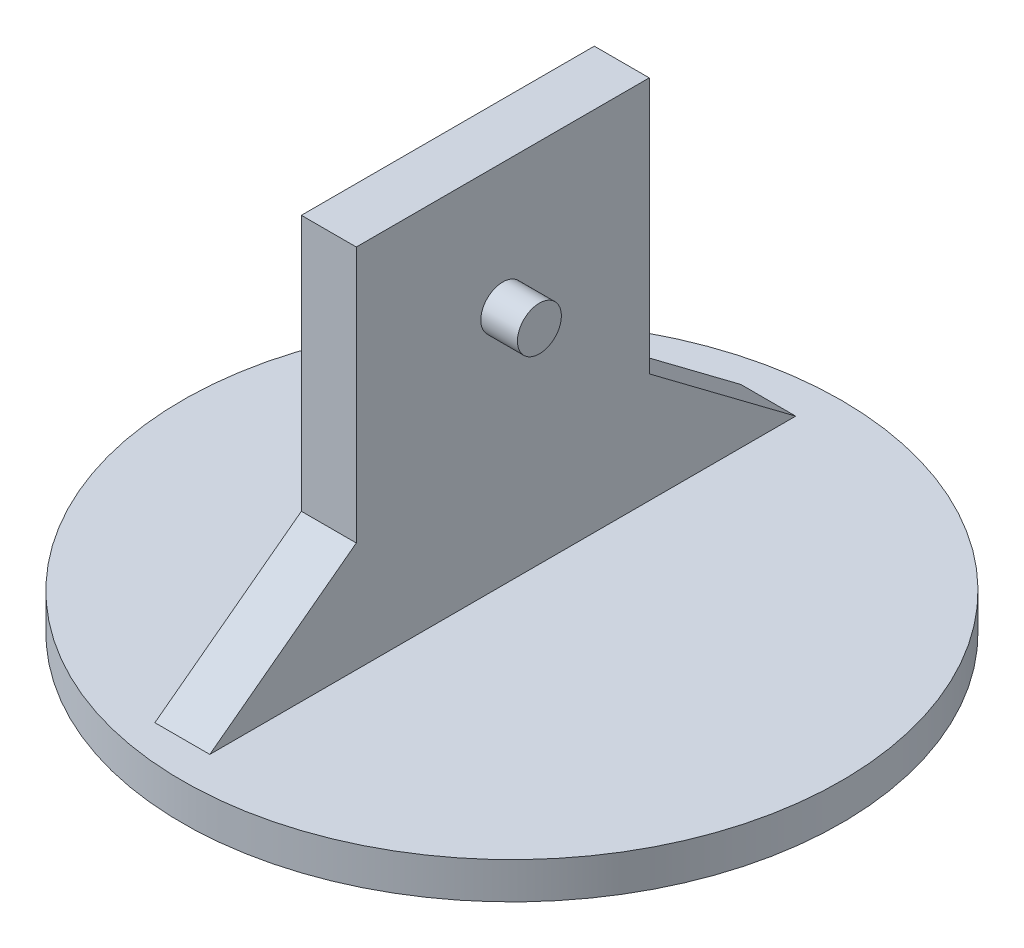
ISO-10303-21;
HEADER;
FILE_DESCRIPTION(('STEP AP214'),'2;1');
FILE_NAME('part.step','',(''),(''),'','','');
FILE_SCHEMA(('AUTOMOTIVE_DESIGN { 1 0 10303 214 1 1 1 1 }'));
ENDSEC;
DATA;
#1=APPLICATION_CONTEXT('core data for automotive mechanical design processes');
#2=APPLICATION_PROTOCOL_DEFINITION('international standard','automotive_design',2000,#1);
#3=PRODUCT_CONTEXT('',#1,'mechanical');
#4=PRODUCT('Part','Part','',(#3));
#5=PRODUCT_RELATED_PRODUCT_CATEGORY('part','',(#4));
#6=PRODUCT_DEFINITION_FORMATION('','',#4);
#7=PRODUCT_DEFINITION_CONTEXT('part definition',#1,'design');
#8=PRODUCT_DEFINITION('design','',#6,#7);
#9=PRODUCT_DEFINITION_SHAPE('','',#8);
#10=(LENGTH_UNIT() NAMED_UNIT(*) SI_UNIT(.MILLI.,.METRE.));
#11=(NAMED_UNIT(*) PLANE_ANGLE_UNIT() SI_UNIT($,.RADIAN.));
#12=(NAMED_UNIT(*) SI_UNIT($,.STERADIAN.) SOLID_ANGLE_UNIT());
#13=UNCERTAINTY_MEASURE_WITH_UNIT(LENGTH_MEASURE(1.E-05),#10,'distance_accuracy_value','');
#14=(GEOMETRIC_REPRESENTATION_CONTEXT(3) GLOBAL_UNCERTAINTY_ASSIGNED_CONTEXT((#13)) GLOBAL_UNIT_ASSIGNED_CONTEXT((#10,
#11,#12)) REPRESENTATION_CONTEXT('',''));
#15=CARTESIAN_POINT('',(0.,0.,0.));
#16=DIRECTION('',(0.,0.,1.));
#17=DIRECTION('',(1.,0.,0.));
#18=AXIS2_PLACEMENT_3D('',#15,#16,#17);
#19=CARTESIAN_POINT('',(15.,6.4,-4.8));
#20=DIRECTION('',(0.,-0.8,0.6));
#21=DIRECTION('',(0.,-0.6,-0.8));
#22=AXIS2_PLACEMENT_3D('',#19,#20,#21);
#23=PLANE('',#22);
#24=DIRECTION('',(0.,0.6,0.8));
#25=VECTOR('',#24,1.);
#26=CARTESIAN_POINT('',(0.,6.4,-4.8));
#27=LINE('',#26,#25);
#28=CARTESIAN_POINT('',(0.,-50.,-80.));
#29=VERTEX_POINT('',#28);
#30=CARTESIAN_POINT('',(0.,-20.,-40.));
#31=VERTEX_POINT('',#30);
#32=EDGE_CURVE('E132',#29,#31,#27,.T.);
#33=ORIENTED_EDGE('',*,*,#32,.T.);
#34=DIRECTION('',(-1.,0.,0.));
#35=VECTOR('',#34,1.);
#36=CARTESIAN_POINT('',(15.,-20.,-40.));
#37=LINE('',#36,#35);
#38=CARTESIAN_POINT('',(15.,-20.,-40.));
#39=VERTEX_POINT('',#38);
#40=EDGE_CURVE('E50',#39,#31,#37,.T.);
#41=ORIENTED_EDGE('',*,*,#40,.F.);
#42=DIRECTION('',(0.,0.6,0.8));
#43=VECTOR('',#42,1.);
#44=CARTESIAN_POINT('',(15.,6.4,-4.8));
#45=LINE('',#44,#43);
#46=CARTESIAN_POINT('',(15.,-50.,-80.));
#47=VERTEX_POINT('',#46);
#48=EDGE_CURVE('E92',#47,#39,#45,.T.);
#49=ORIENTED_EDGE('',*,*,#48,.F.);
#50=DIRECTION('',(-1.,0.,0.));
#51=VECTOR('',#50,1.);
#52=CARTESIAN_POINT('',(15.,-50.,-80.));
#53=LINE('',#52,#51);
#54=EDGE_CURVE('E11',#47,#29,#53,.T.);
#55=ORIENTED_EDGE('',*,*,#54,.T.);
#56=EDGE_LOOP('',(#33,#41,#49,#55));
#57=FACE_BOUND('',#56,.T.);
#58=ADVANCED_FACE('F41',(#57),#23,.F.);
#59=CARTESIAN_POINT('',(15.,0.,-40.));
#60=DIRECTION('',(0.,0.,-1.));
#61=DIRECTION('',(0.,1.,0.));
#62=AXIS2_PLACEMENT_3D('',#59,#60,#61);
#63=PLANE('',#62);
#64=DIRECTION('',(0.,-1.,0.));
#65=VECTOR('',#64,1.);
#66=CARTESIAN_POINT('',(0.,0.,-40.));
#67=LINE('',#66,#65);
#68=CARTESIAN_POINT('',(0.,50.,-40.));
#69=VERTEX_POINT('',#68);
#70=EDGE_CURVE('E137',#69,#31,#67,.T.);
#71=ORIENTED_EDGE('',*,*,#70,.F.);
#72=DIRECTION('',(-1.,0.,0.));
#73=VECTOR('',#72,1.);
#74=CARTESIAN_POINT('',(15.,50.,-40.));
#75=LINE('',#74,#73);
#76=CARTESIAN_POINT('',(15.,50.,-40.));
#77=VERTEX_POINT('',#76);
#78=EDGE_CURVE('E108',#77,#69,#75,.T.);
#79=ORIENTED_EDGE('',*,*,#78,.F.);
#80=DIRECTION('',(0.,-1.,0.));
#81=VECTOR('',#80,1.);
#82=CARTESIAN_POINT('',(15.,0.,-40.));
#83=LINE('',#82,#81);
#84=EDGE_CURVE('E119',#77,#39,#83,.T.);
#85=ORIENTED_EDGE('',*,*,#84,.T.);
#86=ORIENTED_EDGE('',*,*,#40,.T.);
#87=EDGE_LOOP('',(#71,#79,#85,#86));
#88=FACE_BOUND('',#87,.T.);
#89=ADVANCED_FACE('F159',(#88),#63,.T.);
#90=CARTESIAN_POINT('',(15.,50.,0.));
#91=DIRECTION('',(0.,1.,0.));
#92=DIRECTION('',(0.,0.,1.));
#93=AXIS2_PLACEMENT_3D('',#90,#91,#92);
#94=PLANE('',#93);
#95=DIRECTION('',(0.,0.,-1.));
#96=VECTOR('',#95,1.);
#97=CARTESIAN_POINT('',(0.,50.,0.));
#98=LINE('',#97,#96);
#99=CARTESIAN_POINT('',(0.,50.,40.));
#100=VERTEX_POINT('',#99);
#101=EDGE_CURVE('E106',#100,#69,#98,.T.);
#102=ORIENTED_EDGE('',*,*,#101,.F.);
#103=DIRECTION('',(-1.,0.,0.));
#104=VECTOR('',#103,1.);
#105=CARTESIAN_POINT('',(15.,50.,40.));
#106=LINE('',#105,#104);
#107=CARTESIAN_POINT('',(15.,50.,40.));
#108=VERTEX_POINT('',#107);
#109=EDGE_CURVE('E80',#108,#100,#106,.T.);
#110=ORIENTED_EDGE('',*,*,#109,.F.);
#111=DIRECTION('',(0.,0.,-1.));
#112=VECTOR('',#111,1.);
#113=CARTESIAN_POINT('',(15.,50.,0.));
#114=LINE('',#113,#112);
#115=EDGE_CURVE('E104',#108,#77,#114,.T.);
#116=ORIENTED_EDGE('',*,*,#115,.T.);
#117=ORIENTED_EDGE('',*,*,#78,.T.);
#118=EDGE_LOOP('',(#102,#110,#116,#117));
#119=FACE_BOUND('',#118,.T.);
#120=ADVANCED_FACE('F102',(#119),#94,.T.);
#121=CARTESIAN_POINT('',(15.,0.,40.));
#122=DIRECTION('',(0.,0.,-1.));
#123=DIRECTION('',(0.,1.,0.));
#124=AXIS2_PLACEMENT_3D('',#121,#122,#123);
#125=PLANE('',#124);
#126=DIRECTION('',(0.,-1.,0.));
#127=VECTOR('',#126,1.);
#128=CARTESIAN_POINT('',(0.,0.,40.));
#129=LINE('',#128,#127);
#130=CARTESIAN_POINT('',(0.,-20.,40.));
#131=VERTEX_POINT('',#130);
#132=EDGE_CURVE('E143',#100,#131,#129,.T.);
#133=ORIENTED_EDGE('',*,*,#132,.T.);
#134=DIRECTION('',(-1.,0.,0.));
#135=VECTOR('',#134,1.);
#136=CARTESIAN_POINT('',(15.,-20.,40.));
#137=LINE('',#136,#135);
#138=CARTESIAN_POINT('',(15.,-20.,40.));
#139=VERTEX_POINT('',#138);
#140=EDGE_CURVE('E85',#139,#131,#137,.T.);
#141=ORIENTED_EDGE('',*,*,#140,.F.);
#142=DIRECTION('',(0.,-1.,0.));
#143=VECTOR('',#142,1.);
#144=CARTESIAN_POINT('',(15.,0.,40.));
#145=LINE('',#144,#143);
#146=EDGE_CURVE('E110',#108,#139,#145,.T.);
#147=ORIENTED_EDGE('',*,*,#146,.F.);
#148=ORIENTED_EDGE('',*,*,#109,.T.);
#149=EDGE_LOOP('',(#133,#141,#147,#148));
#150=FACE_BOUND('',#149,.T.);
#151=ADVANCED_FACE('F111',(#150),#125,.F.);
#152=CARTESIAN_POINT('',(15.,6.39999999999998,4.79999999999998));
#153=DIRECTION('',(0.,0.8,0.6));
#154=DIRECTION('',(0.,-0.6,0.8));
#155=AXIS2_PLACEMENT_3D('',#152,#153,#154);
#156=PLANE('',#155);
#157=DIRECTION('',(0.,0.6,-0.8));
#158=VECTOR('',#157,1.);
#159=CARTESIAN_POINT('',(0.,6.39999999999998,4.79999999999998));
#160=LINE('',#159,#158);
#161=CARTESIAN_POINT('',(0.,-50.,80.));
#162=VERTEX_POINT('',#161);
#163=EDGE_CURVE('E146',#162,#131,#160,.T.);
#164=ORIENTED_EDGE('',*,*,#163,.F.);
#165=DIRECTION('',(-1.,0.,0.));
#166=VECTOR('',#165,1.);
#167=CARTESIAN_POINT('',(15.,-50.,80.));
#168=LINE('',#167,#166);
#169=CARTESIAN_POINT('',(15.,-50.,80.));
#170=VERTEX_POINT('',#169);
#171=EDGE_CURVE('E58',#170,#162,#168,.T.);
#172=ORIENTED_EDGE('',*,*,#171,.F.);
#173=DIRECTION('',(0.,0.6,-0.8));
#174=VECTOR('',#173,1.);
#175=CARTESIAN_POINT('',(15.,6.39999999999998,4.79999999999998));
#176=LINE('',#175,#174);
#177=EDGE_CURVE('E114',#170,#139,#176,.T.);
#178=ORIENTED_EDGE('',*,*,#177,.T.);
#179=ORIENTED_EDGE('',*,*,#140,.T.);
#180=EDGE_LOOP('',(#164,#172,#178,#179));
#181=FACE_BOUND('',#180,.T.);
#182=ADVANCED_FACE('F164',(#181),#156,.T.);
#183=CARTESIAN_POINT('',(15.,0.,0.));
#184=DIRECTION('',(1.,0.,0.));
#185=DIRECTION('',(0.,0.,-1.));
#186=AXIS2_PLACEMENT_3D('',#183,#184,#185);
#187=PLANE('',#186);
#188=CARTESIAN_POINT('',(15.,15.7289167460341,0.));
#189=DIRECTION('',(1.,0.,0.));
#190=DIRECTION('',(0.,0.,-1.));
#191=AXIS2_PLACEMENT_3D('',#188,#189,#190);
#192=CIRCLE('',#191,6.);
#193=CARTESIAN_POINT('',(15.,15.7289167460341,-6.));
#194=VERTEX_POINT('',#193);
#195=EDGE_CURVE('E294',#194,#194,#192,.T.);
#196=ORIENTED_EDGE('',*,*,#195,.F.);
#197=EDGE_LOOP('',(#196));
#198=FACE_BOUND('',#197,.T.);
#199=DIRECTION('',(0.,0.,-1.));
#200=VECTOR('',#199,1.);
#201=CARTESIAN_POINT('',(15.,-50.,0.));
#202=LINE('',#201,#200);
#203=EDGE_CURVE('E150',#170,#47,#202,.T.);
#204=ORIENTED_EDGE('',*,*,#203,.T.);
#205=ORIENTED_EDGE('',*,*,#48,.T.);
#206=ORIENTED_EDGE('',*,*,#84,.F.);
#207=ORIENTED_EDGE('',*,*,#115,.F.);
#208=ORIENTED_EDGE('',*,*,#146,.T.);
#209=ORIENTED_EDGE('',*,*,#177,.F.);
#210=EDGE_LOOP('',(#204,#205,#206,#207,#208,#209));
#211=FACE_BOUND('',#210,.T.);
#212=ADVANCED_FACE('F117',(#198,#211),#187,.T.);
#213=CARTESIAN_POINT('',(0.,0.,0.));
#214=DIRECTION('',(1.,0.,0.));
#215=DIRECTION('',(0.,0.,-1.));
#216=AXIS2_PLACEMENT_3D('',#213,#214,#215);
#217=PLANE('',#216);
#218=DIRECTION('',(0.,0.,-1.));
#219=VECTOR('',#218,1.);
#220=CARTESIAN_POINT('',(0.,-50.,0.));
#221=LINE('',#220,#219);
#222=EDGE_CURVE('E128',#162,#29,#221,.T.);
#223=ORIENTED_EDGE('',*,*,#222,.F.);
#224=ORIENTED_EDGE('',*,*,#163,.T.);
#225=ORIENTED_EDGE('',*,*,#132,.F.);
#226=ORIENTED_EDGE('',*,*,#101,.T.);
#227=ORIENTED_EDGE('',*,*,#70,.T.);
#228=ORIENTED_EDGE('',*,*,#32,.F.);
#229=EDGE_LOOP('',(#223,#224,#225,#226,#227,#228));
#230=FACE_BOUND('',#229,.T.);
#231=ADVANCED_FACE('F163',(#230),#217,.F.);
#232=CARTESIAN_POINT('',(17.5,-50.,0.));
#233=DIRECTION('',(0.,-1.,0.));
#234=DIRECTION('',(0.,0.,-1.));
#235=AXIS2_PLACEMENT_3D('',#232,#233,#234);
#236=PLANE('',#235);
#237=CARTESIAN_POINT('',(17.5,-50.,0.));
#238=DIRECTION('',(0.,-1.,0.));
#239=DIRECTION('',(0.,0.,-1.));
#240=AXIS2_PLACEMENT_3D('',#237,#238,#239);
#241=CIRCLE('',#240,90.);
#242=CARTESIAN_POINT('',(17.5,-50.,-90.));
#243=VERTEX_POINT('',#242);
#244=EDGE_CURVE('E307',#243,#243,#241,.T.);
#245=ORIENTED_EDGE('',*,*,#244,.F.);
#246=EDGE_LOOP('',(#245));
#247=FACE_BOUND('',#246,.T.);
#248=ORIENTED_EDGE('',*,*,#171,.T.);
#249=ORIENTED_EDGE('',*,*,#222,.T.);
#250=ORIENTED_EDGE('',*,*,#54,.F.);
#251=ORIENTED_EDGE('',*,*,#203,.F.);
#252=EDGE_LOOP('',(#248,#249,#250,#251));
#253=FACE_BOUND('',#252,.T.);
#254=ADVANCED_FACE('F209',(#247,#253),#236,.F.);
#255=CARTESIAN_POINT('',(17.5,-60.,0.));
#256=DIRECTION('',(0.,1.,0.));
#257=DIRECTION('',(0.,0.,1.));
#258=AXIS2_PLACEMENT_3D('',#255,#256,#257);
#259=CYLINDRICAL_SURFACE('',#258,90.);
#260=CARTESIAN_POINT('',(17.5,-60.,0.));
#261=DIRECTION('',(0.,-1.,0.));
#262=DIRECTION('',(0.,0.,-1.));
#263=AXIS2_PLACEMENT_3D('',#260,#261,#262);
#264=CIRCLE('',#263,90.);
#265=CARTESIAN_POINT('',(17.5,-60.,-90.));
#266=VERTEX_POINT('',#265);
#267=EDGE_CURVE('E133',#266,#266,#264,.T.);
#268=ORIENTED_EDGE('',*,*,#267,.F.);
#269=EDGE_LOOP('',(#268));
#270=FACE_BOUND('',#269,.T.);
#271=ORIENTED_EDGE('',*,*,#244,.T.);
#272=EDGE_LOOP('',(#271));
#273=FACE_BOUND('',#272,.T.);
#274=ADVANCED_FACE('F218',(#270,#273),#259,.T.);
#275=CARTESIAN_POINT('',(17.5,-60.,0.));
#276=DIRECTION('',(0.,-1.,0.));
#277=DIRECTION('',(0.,0.,-1.));
#278=AXIS2_PLACEMENT_3D('',#275,#276,#277);
#279=PLANE('',#278);
#280=CARTESIAN_POINT('',(17.5,-60.,0.));
#281=DIRECTION('',(0.,-1.,0.));
#282=DIRECTION('',(0.,0.,-1.));
#283=AXIS2_PLACEMENT_3D('',#280,#281,#282);
#284=CIRCLE('',#283,5.);
#285=CARTESIAN_POINT('',(17.5,-60.,-4.99999999999993));
#286=VERTEX_POINT('',#285);
#287=EDGE_CURVE('E295',#286,#286,#284,.T.);
#288=ORIENTED_EDGE('',*,*,#287,.F.);
#289=EDGE_LOOP('',(#288));
#290=FACE_BOUND('',#289,.T.);
#291=ORIENTED_EDGE('',*,*,#267,.T.);
#292=EDGE_LOOP('',(#291));
#293=FACE_BOUND('',#292,.T.);
#294=ADVANCED_FACE('F228',(#290,#293),#279,.T.);
#295=CARTESIAN_POINT('',(25.,15.7289167460341,0.));
#296=DIRECTION('',(-1.,0.,0.));
#297=DIRECTION('',(0.,0.,1.));
#298=AXIS2_PLACEMENT_3D('',#295,#296,#297);
#299=CYLINDRICAL_SURFACE('',#298,6.);
#300=CARTESIAN_POINT('',(25.,15.7289167460341,0.));
#301=DIRECTION('',(1.,0.,0.));
#302=DIRECTION('',(0.,0.,-1.));
#303=AXIS2_PLACEMENT_3D('',#300,#301,#302);
#304=CIRCLE('',#303,6.);
#305=CARTESIAN_POINT('',(25.,15.7289167460341,-6.));
#306=VERTEX_POINT('',#305);
#307=EDGE_CURVE('E300',#306,#306,#304,.T.);
#308=ORIENTED_EDGE('',*,*,#307,.F.);
#309=EDGE_LOOP('',(#308));
#310=FACE_BOUND('',#309,.T.);
#311=ORIENTED_EDGE('',*,*,#195,.T.);
#312=EDGE_LOOP('',(#311));
#313=FACE_BOUND('',#312,.T.);
#314=ADVANCED_FACE('F244',(#310,#313),#299,.T.);
#315=CARTESIAN_POINT('',(25.,15.7289167460341,0.));
#316=DIRECTION('',(1.,0.,0.));
#317=DIRECTION('',(0.,0.,-1.));
#318=AXIS2_PLACEMENT_3D('',#315,#316,#317);
#319=PLANE('',#318);
#320=ORIENTED_EDGE('',*,*,#307,.T.);
#321=EDGE_LOOP('',(#320));
#322=FACE_BOUND('',#321,.T.);
#323=ADVANCED_FACE('F249',(#322),#319,.T.);
#324=CARTESIAN_POINT('',(17.5,-70.,0.));
#325=DIRECTION('',(0.,1.,0.));
#326=DIRECTION('',(0.,0.,1.));
#327=AXIS2_PLACEMENT_3D('',#324,#325,#326);
#328=CYLINDRICAL_SURFACE('',#327,5.);
#329=CARTESIAN_POINT('',(17.5,-70.,0.));
#330=DIRECTION('',(0.,-1.,0.));
#331=DIRECTION('',(0.,0.,-1.));
#332=AXIS2_PLACEMENT_3D('',#329,#330,#331);
#333=CIRCLE('',#332,5.);
#334=CARTESIAN_POINT('',(17.5,-70.,-4.99999999999993));
#335=VERTEX_POINT('',#334);
#336=EDGE_CURVE('E292',#335,#335,#333,.T.);
#337=ORIENTED_EDGE('',*,*,#336,.F.);
#338=EDGE_LOOP('',(#337));
#339=FACE_BOUND('',#338,.T.);
#340=ORIENTED_EDGE('',*,*,#287,.T.);
#341=EDGE_LOOP('',(#340));
#342=FACE_BOUND('',#341,.T.);
#343=ADVANCED_FACE('F259',(#339,#342),#328,.T.);
#344=CARTESIAN_POINT('',(17.5,-70.,0.));
#345=DIRECTION('',(0.,-1.,0.));
#346=DIRECTION('',(0.,0.,-1.));
#347=AXIS2_PLACEMENT_3D('',#344,#345,#346);
#348=PLANE('',#347);
#349=ORIENTED_EDGE('',*,*,#336,.T.);
#350=EDGE_LOOP('',(#349));
#351=FACE_BOUND('',#350,.T.);
#352=ADVANCED_FACE('F276',(#351),#348,.T.);
#353=CLOSED_SHELL('',(#58,#89,#120,#151,#182,#212,#231,#254,#274,#294,#314,#323,#343,#352));
#354=MANIFOLD_SOLID_BREP('B2',#353);
#355=ADVANCED_BREP_SHAPE_REPRESENTATION('',(#18,#354),#14);
#356=SHAPE_DEFINITION_REPRESENTATION(#9,#355);
ENDSEC;
END-ISO-10303-21;
